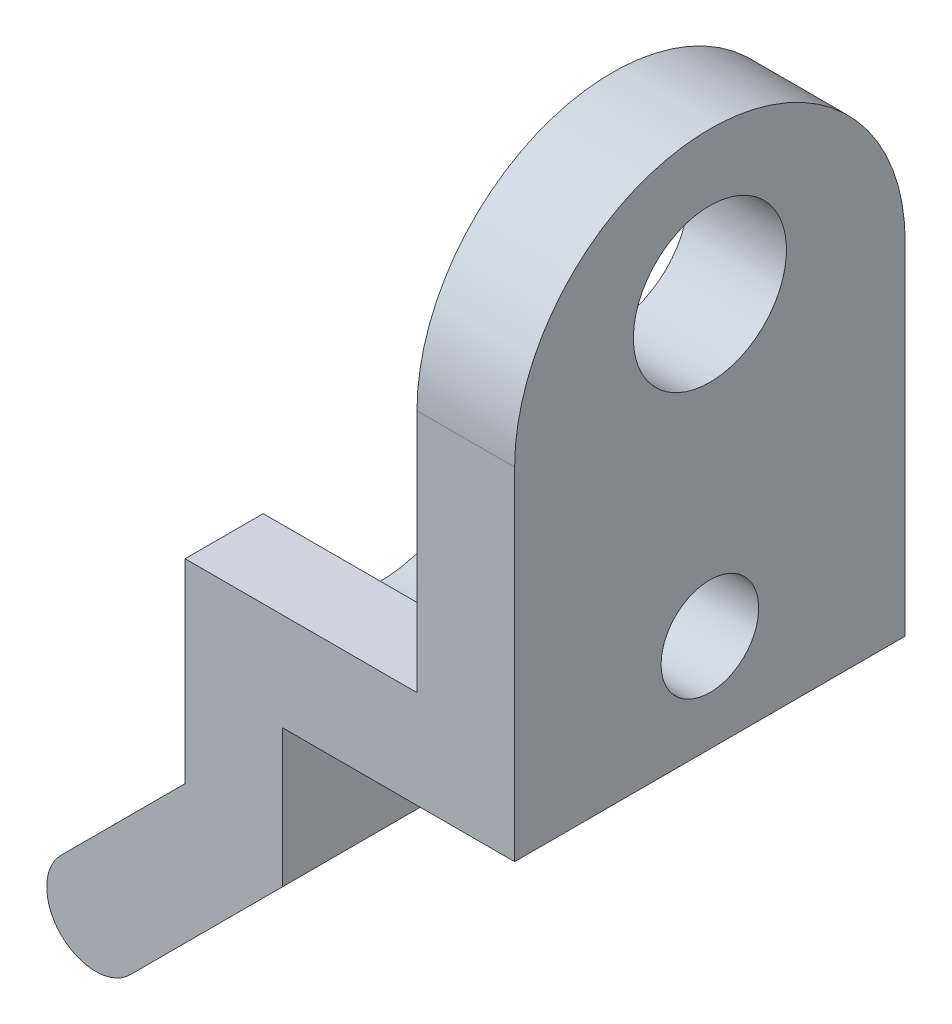
ISO-10303-21;
HEADER;
FILE_DESCRIPTION(('STEP AP214'),'2;1');
FILE_NAME('part.step','',(''),(''),'','','');
FILE_SCHEMA(('AUTOMOTIVE_DESIGN { 1 0 10303 214 1 1 1 1 }'));
ENDSEC;
DATA;
#1=APPLICATION_CONTEXT('core data for automotive mechanical design processes');
#2=APPLICATION_PROTOCOL_DEFINITION('international standard','automotive_design',2000,#1);
#3=PRODUCT_CONTEXT('',#1,'mechanical');
#4=PRODUCT('Part','Part','',(#3));
#5=PRODUCT_RELATED_PRODUCT_CATEGORY('part','',(#4));
#6=PRODUCT_DEFINITION_FORMATION('','',#4);
#7=PRODUCT_DEFINITION_CONTEXT('part definition',#1,'design');
#8=PRODUCT_DEFINITION('design','',#6,#7);
#9=PRODUCT_DEFINITION_SHAPE('','',#8);
#10=(LENGTH_UNIT() NAMED_UNIT(*) SI_UNIT(.MILLI.,.METRE.));
#11=(NAMED_UNIT(*) PLANE_ANGLE_UNIT() SI_UNIT($,.RADIAN.));
#12=(NAMED_UNIT(*) SI_UNIT($,.STERADIAN.) SOLID_ANGLE_UNIT());
#13=UNCERTAINTY_MEASURE_WITH_UNIT(LENGTH_MEASURE(1.E-05),#10,'distance_accuracy_value','');
#14=(GEOMETRIC_REPRESENTATION_CONTEXT(3) GLOBAL_UNCERTAINTY_ASSIGNED_CONTEXT((#13)) GLOBAL_UNIT_ASSIGNED_CONTEXT((#10,
#11,#12)) REPRESENTATION_CONTEXT('',''));
#15=CARTESIAN_POINT('',(0.,0.,0.));
#16=DIRECTION('',(0.,0.,1.));
#17=DIRECTION('',(1.,0.,0.));
#18=AXIS2_PLACEMENT_3D('',#15,#16,#17);
#19=CARTESIAN_POINT('',(0.,4.76250000000006,6.35));
#20=DIRECTION('',(0.,1.,0.));
#21=DIRECTION('',(0.,0.,1.));
#22=AXIS2_PLACEMENT_3D('',#19,#20,#21);
#23=PLANE('',#22);
#24=DIRECTION('',(-1.,0.,0.));
#25=VECTOR('',#24,1.);
#26=CARTESIAN_POINT('',(4.02943234528298,4.76250000000006,-3.81));
#27=LINE('',#26,#25);
#28=CARTESIAN_POINT('',(-6.746875,4.76250000000006,-3.81));
#29=VERTEX_POINT('',#28);
#30=CARTESIAN_POINT('',(-14.2874999999999,4.76250000000006,-3.81));
#31=VERTEX_POINT('',#30);
#32=EDGE_CURVE('E78',#29,#31,#27,.T.);
#33=ORIENTED_EDGE('',*,*,#32,.F.);
#34=DIRECTION('',(0.,0.,1.));
#35=VECTOR('',#34,1.);
#36=CARTESIAN_POINT('',(-6.746875,4.76250000000006,6.35));
#37=LINE('',#36,#35);
#38=CARTESIAN_POINT('',(-6.746875,4.76250000000006,-6.35));
#39=VERTEX_POINT('',#38);
#40=EDGE_CURVE('E261',#39,#29,#37,.T.);
#41=ORIENTED_EDGE('',*,*,#40,.F.);
#42=DIRECTION('',(1.,0.,0.));
#43=VECTOR('',#42,1.);
#44=CARTESIAN_POINT('',(0.,4.76250000000006,-6.35));
#45=LINE('',#44,#43);
#46=CARTESIAN_POINT('',(-14.2874999999999,4.76250000000006,-6.35));
#47=VERTEX_POINT('',#46);
#48=EDGE_CURVE('E186',#47,#39,#45,.T.);
#49=ORIENTED_EDGE('',*,*,#48,.F.);
#50=DIRECTION('',(0.,0.,-1.));
#51=VECTOR('',#50,1.);
#52=CARTESIAN_POINT('',(-14.2874999999999,4.76250000000006,6.35));
#53=LINE('',#52,#51);
#54=EDGE_CURVE('E323',#31,#47,#53,.T.);
#55=ORIENTED_EDGE('',*,*,#54,.F.);
#56=EDGE_LOOP('',(#33,#41,#49,#55));
#57=FACE_BOUND('',#56,.T.);
#58=ADVANCED_FACE('F48',(#57),#23,.T.);
#59=CARTESIAN_POINT('',(-6.35826106431797,6.35826106431797,6.35));
#60=DIRECTION('',(0.707106781186548,-0.707106781186548,0.));
#61=DIRECTION('',(0.707106781186548,0.707106781186548,0.));
#62=AXIS2_PLACEMENT_3D('',#59,#60,#61);
#63=PLANE('',#62);
#64=CARTESIAN_POINT('',(-16.0758571097189,-3.35933498108292,0.));
#65=DIRECTION('',(0.707106781186548,-0.707106781186548,0.));
#66=DIRECTION('',(0.707106781186548,0.707106781186548,0.));
#67=AXIS2_PLACEMENT_3D('',#64,#65,#66);
#68=CIRCLE('',#67,1.5875);
#69=CARTESIAN_POINT('',(-14.9533250945852,-2.23680296594928,0.));
#70=VERTEX_POINT('',#69);
#71=EDGE_CURVE('E265',#70,#70,#68,.T.);
#72=ORIENTED_EDGE('',*,*,#71,.T.);
#73=EDGE_LOOP('',(#72));
#74=FACE_BOUND('',#73,.T.);
#75=DIRECTION('',(-0.707106781186548,-0.707106781186548,0.));
#76=VECTOR('',#75,1.);
#77=CARTESIAN_POINT('',(-6.35826106431797,6.35826106431797,-6.35));
#78=LINE('',#77,#76);
#79=CARTESIAN_POINT('',(-14.2874999999999,-1.570977871364,-6.35));
#80=VERTEX_POINT('',#79);
#81=CARTESIAN_POINT('',(-18.3209211399862,-5.60439901135021,-6.35));
#82=VERTEX_POINT('',#81);
#83=EDGE_CURVE('E269',#80,#82,#78,.T.);
#84=ORIENTED_EDGE('',*,*,#83,.T.);
#85=DIRECTION('',(0.,0.,-1.));
#86=VECTOR('',#85,1.);
#87=CARTESIAN_POINT('',(-18.3209211399862,-5.60439901135021,6.35));
#88=LINE('',#87,#86);
#89=CARTESIAN_POINT('',(-18.3209211399862,-5.60439901135021,6.35));
#90=VERTEX_POINT('',#89);
#91=EDGE_CURVE('E58',#90,#82,#88,.T.);
#92=ORIENTED_EDGE('',*,*,#91,.F.);
#93=DIRECTION('',(-0.707106781186548,-0.707106781186548,0.));
#94=VECTOR('',#93,1.);
#95=CARTESIAN_POINT('',(-6.35826106431797,6.35826106431797,6.35));
#96=LINE('',#95,#94);
#97=CARTESIAN_POINT('',(-14.2874999999999,-1.570977871364,6.35));
#98=VERTEX_POINT('',#97);
#99=EDGE_CURVE('E270',#98,#90,#96,.T.);
#100=ORIENTED_EDGE('',*,*,#99,.F.);
#101=DIRECTION('',(0.,0.,-1.));
#102=VECTOR('',#101,1.);
#103=CARTESIAN_POINT('',(-14.2874999999999,-1.570977871364,6.35));
#104=LINE('',#103,#102);
#105=EDGE_CURVE('E297',#98,#80,#104,.T.);
#106=ORIENTED_EDGE('',*,*,#105,.T.);
#107=EDGE_LOOP('',(#84,#92,#100,#106));
#108=FACE_BOUND('',#107,.T.);
#109=ADVANCED_FACE('F51',(#74,#108),#63,.F.);
#110=CARTESIAN_POINT('',(-17.1983891248525,-6.72693102648386,6.35));
#111=DIRECTION('',(0.,0.,-1.));
#112=DIRECTION('',(-1.,0.,0.));
#113=AXIS2_PLACEMENT_3D('',#110,#111,#112);
#114=CYLINDRICAL_SURFACE('',#113,1.5875);
#115=CARTESIAN_POINT('',(-17.1983891248525,-6.72693102648386,-6.35));
#116=DIRECTION('',(0.,0.,1.));
#117=DIRECTION('',(1.,0.,0.));
#118=AXIS2_PLACEMENT_3D('',#115,#116,#117);
#119=CIRCLE('',#118,1.5875);
#120=CARTESIAN_POINT('',(-16.0758571097189,-7.8494630416175,-6.35));
#121=VERTEX_POINT('',#120);
#122=EDGE_CURVE('E301',#82,#121,#119,.T.);
#123=ORIENTED_EDGE('',*,*,#122,.T.);
#124=DIRECTION('',(0.,0.,-1.));
#125=VECTOR('',#124,1.);
#126=CARTESIAN_POINT('',(-16.0758571097189,-7.8494630416175,6.35));
#127=LINE('',#126,#125);
#128=CARTESIAN_POINT('',(-16.0758571097189,-7.8494630416175,6.35));
#129=VERTEX_POINT('',#128);
#130=EDGE_CURVE('E336',#129,#121,#127,.T.);
#131=ORIENTED_EDGE('',*,*,#130,.F.);
#132=CARTESIAN_POINT('',(-17.1983891248525,-6.72693102648386,6.35));
#133=DIRECTION('',(0.,0.,1.));
#134=DIRECTION('',(1.,0.,0.));
#135=AXIS2_PLACEMENT_3D('',#132,#133,#134);
#136=CIRCLE('',#135,1.5875);
#137=EDGE_CURVE('E274',#90,#129,#136,.T.);
#138=ORIENTED_EDGE('',*,*,#137,.F.);
#139=ORIENTED_EDGE('',*,*,#91,.T.);
#140=EDGE_LOOP('',(#123,#131,#138,#139));
#141=FACE_BOUND('',#140,.T.);
#142=ADVANCED_FACE('F352',(#141),#114,.T.);
#143=CARTESIAN_POINT('',(-4.11319703405068,4.11319703405068,6.35));
#144=DIRECTION('',(0.707106781186548,-0.707106781186548,0.));
#145=DIRECTION('',(0.707106781186548,0.707106781186548,0.));
#146=AXIS2_PLACEMENT_3D('',#143,#144,#145);
#147=PLANE('',#146);
#148=CARTESIAN_POINT('',(-13.8307930794516,-5.60439901135021,0.));
#149=DIRECTION('',(0.707106781186548,-0.707106781186548,0.));
#150=DIRECTION('',(0.707106781186548,0.707106781186548,0.));
#151=AXIS2_PLACEMENT_3D('',#148,#149,#150);
#152=CIRCLE('',#151,1.5875);
#153=CARTESIAN_POINT('',(-12.7082610643179,-4.48186699621656,0.));
#154=VERTEX_POINT('',#153);
#155=EDGE_CURVE('E264',#154,#154,#152,.T.);
#156=ORIENTED_EDGE('',*,*,#155,.F.);
#157=EDGE_LOOP('',(#156));
#158=FACE_BOUND('',#157,.T.);
#159=DIRECTION('',(-0.707106781186548,-0.707106781186548,0.));
#160=VECTOR('',#159,1.);
#161=CARTESIAN_POINT('',(-4.11319703405068,4.11319703405068,-6.35));
#162=LINE('',#161,#160);
#163=CARTESIAN_POINT('',(-11.1124999999999,-2.88610593189857,-6.35));
#164=VERTEX_POINT('',#163);
#165=EDGE_CURVE('E305',#164,#121,#162,.T.);
#166=ORIENTED_EDGE('',*,*,#165,.F.);
#167=DIRECTION('',(0.,0.,-1.));
#168=VECTOR('',#167,1.);
#169=CARTESIAN_POINT('',(-11.1124999999999,-2.88610593189857,6.35));
#170=LINE('',#169,#168);
#171=CARTESIAN_POINT('',(-11.1124999999999,-2.88610593189857,6.35));
#172=VERTEX_POINT('',#171);
#173=EDGE_CURVE('E333',#172,#164,#170,.T.);
#174=ORIENTED_EDGE('',*,*,#173,.F.);
#175=DIRECTION('',(-0.707106781186548,-0.707106781186548,0.));
#176=VECTOR('',#175,1.);
#177=CARTESIAN_POINT('',(-4.11319703405068,4.11319703405068,6.35));
#178=LINE('',#177,#176);
#179=EDGE_CURVE('E278',#172,#129,#178,.T.);
#180=ORIENTED_EDGE('',*,*,#179,.T.);
#181=ORIENTED_EDGE('',*,*,#130,.T.);
#182=EDGE_LOOP('',(#166,#174,#180,#181));
#183=FACE_BOUND('',#182,.T.);
#184=ADVANCED_FACE('F348',(#158,#183),#147,.T.);
#185=CARTESIAN_POINT('',(-11.1124999999999,0.,6.35));
#186=DIRECTION('',(-1.,0.,0.));
#187=DIRECTION('',(0.,0.,1.));
#188=AXIS2_PLACEMENT_3D('',#185,#186,#187);
#189=PLANE('',#188);
#190=DIRECTION('',(0.,0.,-1.));
#191=VECTOR('',#190,1.);
#192=CARTESIAN_POINT('',(-11.1124999999999,1.58750000000006,6.35));
#193=LINE('',#192,#191);
#194=CARTESIAN_POINT('',(-11.1124999999999,1.58750000000006,-2.10605674187568));
#195=VERTEX_POINT('',#194);
#196=CARTESIAN_POINT('',(-11.1124999999999,1.58750000000006,-6.35));
#197=VERTEX_POINT('',#196);
#198=EDGE_CURVE('E328',#195,#197,#193,.T.);
#199=ORIENTED_EDGE('',*,*,#198,.F.);
#200=CARTESIAN_POINT('',(-11.1124999999999,4.76250000000006,0.));
#201=DIRECTION('',(-1.,0.,0.));
#202=DIRECTION('',(0.,0.,1.));
#203=AXIS2_PLACEMENT_3D('',#200,#201,#202);
#204=CIRCLE('',#203,3.81);
#205=CARTESIAN_POINT('',(-11.1124999999999,1.58750000000006,2.10605674187568));
#206=VERTEX_POINT('',#205);
#207=EDGE_CURVE('E244',#195,#206,#204,.T.);
#208=ORIENTED_EDGE('',*,*,#207,.T.);
#209=CARTESIAN_POINT('',(-11.1124999999999,1.58750000000006,6.35));
#210=VERTEX_POINT('',#209);
#211=EDGE_CURVE('E329',#210,#206,#193,.T.);
#212=ORIENTED_EDGE('',*,*,#211,.F.);
#213=DIRECTION('',(0.,1.,0.));
#214=VECTOR('',#213,1.);
#215=CARTESIAN_POINT('',(-11.1124999999999,0.,6.35));
#216=LINE('',#215,#214);
#217=EDGE_CURVE('E282',#172,#210,#216,.T.);
#218=ORIENTED_EDGE('',*,*,#217,.F.);
#219=ORIENTED_EDGE('',*,*,#173,.T.);
#220=DIRECTION('',(0.,1.,0.));
#221=VECTOR('',#220,1.);
#222=CARTESIAN_POINT('',(-11.1124999999999,0.,-6.35));
#223=LINE('',#222,#221);
#224=EDGE_CURVE('E309',#164,#197,#223,.T.);
#225=ORIENTED_EDGE('',*,*,#224,.T.);
#226=EDGE_LOOP('',(#199,#208,#212,#218,#219,#225));
#227=FACE_BOUND('',#226,.T.);
#228=ADVANCED_FACE('F351',(#227),#189,.F.);
#229=CARTESIAN_POINT('',(0.,1.58750000000006,6.35));
#230=DIRECTION('',(0.,1.,0.));
#231=DIRECTION('',(0.,0.,1.));
#232=AXIS2_PLACEMENT_3D('',#229,#230,#231);
#233=PLANE('',#232);
#234=DIRECTION('',(1.,0.,0.));
#235=VECTOR('',#234,1.);
#236=CARTESIAN_POINT('',(0.,1.58750000000006,-6.35));
#237=LINE('',#236,#235);
#238=CARTESIAN_POINT('',(-3.571875,1.58750000000006,-6.35));
#239=VERTEX_POINT('',#238);
#240=EDGE_CURVE('E313',#197,#239,#237,.T.);
#241=ORIENTED_EDGE('',*,*,#240,.T.);
#242=DIRECTION('',(0.,0.,1.));
#243=VECTOR('',#242,1.);
#244=CARTESIAN_POINT('',(-3.571875,1.58750000000006,-6.35));
#245=LINE('',#244,#243);
#246=CARTESIAN_POINT('',(-3.571875,1.58750000000006,6.35));
#247=VERTEX_POINT('',#246);
#248=EDGE_CURVE('E220',#239,#247,#245,.T.);
#249=ORIENTED_EDGE('',*,*,#248,.T.);
#250=DIRECTION('',(1.,0.,0.));
#251=VECTOR('',#250,1.);
#252=CARTESIAN_POINT('',(0.,1.58750000000006,6.35));
#253=LINE('',#252,#251);
#254=EDGE_CURVE('E285',#210,#247,#253,.T.);
#255=ORIENTED_EDGE('',*,*,#254,.F.);
#256=ORIENTED_EDGE('',*,*,#211,.T.);
#257=DIRECTION('',(-1.,0.,0.));
#258=VECTOR('',#257,1.);
#259=CARTESIAN_POINT('',(4.02943234528298,1.58750000000006,2.10605674187568));
#260=LINE('',#259,#258);
#261=CARTESIAN_POINT('',(-6.746875,1.58750000000006,2.10605674187568));
#262=VERTEX_POINT('',#261);
#263=EDGE_CURVE('E240',#206,#262,#260,.F.);
#264=ORIENTED_EDGE('',*,*,#263,.T.);
#265=DIRECTION('',(0.,0.,1.));
#266=VECTOR('',#265,1.);
#267=CARTESIAN_POINT('',(-6.746875,1.58750000000006,6.35));
#268=LINE('',#267,#266);
#269=CARTESIAN_POINT('',(-6.746875,1.58750000000006,-2.10605674187568));
#270=VERTEX_POINT('',#269);
#271=EDGE_CURVE('E191',#270,#262,#268,.T.);
#272=ORIENTED_EDGE('',*,*,#271,.F.);
#273=DIRECTION('',(-1.,0.,0.));
#274=VECTOR('',#273,1.);
#275=CARTESIAN_POINT('',(4.02943234528298,1.58750000000006,-2.10605674187568));
#276=LINE('',#275,#274);
#277=EDGE_CURVE('E248',#270,#195,#276,.T.);
#278=ORIENTED_EDGE('',*,*,#277,.T.);
#279=ORIENTED_EDGE('',*,*,#198,.T.);
#280=EDGE_LOOP('',(#241,#249,#255,#256,#264,#272,#278,#279));
#281=FACE_BOUND('',#280,.T.);
#282=ADVANCED_FACE('F388',(#281),#233,.F.);
#283=DIRECTION('',(-1.,0.,0.));
#284=VECTOR('',#283,1.);
#285=CARTESIAN_POINT('',(4.02943234528298,4.76250000000006,3.81));
#286=LINE('',#285,#284);
#287=CARTESIAN_POINT('',(-14.2874999999999,4.76250000000006,3.81));
#288=VERTEX_POINT('',#287);
#289=CARTESIAN_POINT('',(-6.746875,4.76250000000006,3.81));
#290=VERTEX_POINT('',#289);
#291=EDGE_CURVE('E235',#288,#290,#286,.F.);
#292=ORIENTED_EDGE('',*,*,#291,.F.);
#293=CARTESIAN_POINT('',(-14.2874999999999,4.76250000000006,6.35));
#294=VERTEX_POINT('',#293);
#295=EDGE_CURVE('E324',#294,#288,#53,.T.);
#296=ORIENTED_EDGE('',*,*,#295,.F.);
#297=DIRECTION('',(1.,0.,0.));
#298=VECTOR('',#297,1.);
#299=CARTESIAN_POINT('',(0.,4.76250000000006,6.35));
#300=LINE('',#299,#298);
#301=CARTESIAN_POINT('',(-6.746875,4.76250000000006,6.35));
#302=VERTEX_POINT('',#301);
#303=EDGE_CURVE('E289',#294,#302,#300,.T.);
#304=ORIENTED_EDGE('',*,*,#303,.T.);
#305=EDGE_CURVE('E257',#290,#302,#37,.T.);
#306=ORIENTED_EDGE('',*,*,#305,.F.);
#307=EDGE_LOOP('',(#292,#296,#304,#306));
#308=FACE_BOUND('',#307,.T.);
#309=ADVANCED_FACE('F380',(#308),#23,.T.);
#310=CARTESIAN_POINT('',(-14.2874999999999,0.,6.35));
#311=DIRECTION('',(-1.,0.,0.));
#312=DIRECTION('',(0.,0.,1.));
#313=AXIS2_PLACEMENT_3D('',#310,#311,#312);
#314=PLANE('',#313);
#315=CARTESIAN_POINT('',(-14.2874999999999,4.76250000000006,0.));
#316=DIRECTION('',(-1.,0.,0.));
#317=DIRECTION('',(0.,0.,1.));
#318=AXIS2_PLACEMENT_3D('',#315,#316,#317);
#319=CIRCLE('',#318,3.81);
#320=EDGE_CURVE('E228',#31,#288,#319,.T.);
#321=ORIENTED_EDGE('',*,*,#320,.F.);
#322=ORIENTED_EDGE('',*,*,#54,.T.);
#323=DIRECTION('',(0.,1.,0.));
#324=VECTOR('',#323,1.);
#325=CARTESIAN_POINT('',(-14.2874999999999,0.,-6.35));
#326=LINE('',#325,#324);
#327=EDGE_CURVE('E275',#80,#47,#326,.T.);
#328=ORIENTED_EDGE('',*,*,#327,.F.);
#329=ORIENTED_EDGE('',*,*,#105,.F.);
#330=DIRECTION('',(0.,1.,0.));
#331=VECTOR('',#330,1.);
#332=CARTESIAN_POINT('',(-14.2874999999999,0.,6.35));
#333=LINE('',#332,#331);
#334=EDGE_CURVE('E293',#98,#294,#333,.T.);
#335=ORIENTED_EDGE('',*,*,#334,.T.);
#336=ORIENTED_EDGE('',*,*,#295,.T.);
#337=EDGE_LOOP('',(#321,#322,#328,#329,#335,#336));
#338=FACE_BOUND('',#337,.T.);
#339=ADVANCED_FACE('F374',(#338),#314,.T.);
#340=CARTESIAN_POINT('',(0.,0.,6.35));
#341=DIRECTION('',(0.,0.,1.));
#342=DIRECTION('',(1.,0.,0.));
#343=AXIS2_PLACEMENT_3D('',#340,#341,#342);
#344=PLANE('',#343);
#345=ORIENTED_EDGE('',*,*,#254,.T.);
#346=DIRECTION('',(0.,1.,0.));
#347=VECTOR('',#346,1.);
#348=CARTESIAN_POINT('',(-3.571875,0.,6.35));
#349=LINE('',#348,#347);
#350=CARTESIAN_POINT('',(-3.571875,12.7000000000001,6.35));
#351=VERTEX_POINT('',#350);
#352=EDGE_CURVE('E255',#247,#351,#349,.T.);
#353=ORIENTED_EDGE('',*,*,#352,.T.);
#354=DIRECTION('',(1.,0.,0.));
#355=VECTOR('',#354,1.);
#356=CARTESIAN_POINT('',(-22.621875,12.7000000000001,6.35));
#357=LINE('',#356,#355);
#358=CARTESIAN_POINT('',(-6.746875,12.7000000000001,6.35));
#359=VERTEX_POINT('',#358);
#360=EDGE_CURVE('E201',#359,#351,#357,.T.);
#361=ORIENTED_EDGE('',*,*,#360,.F.);
#362=DIRECTION('',(0.,1.,0.));
#363=VECTOR('',#362,1.);
#364=CARTESIAN_POINT('',(-6.746875,0.,6.35));
#365=LINE('',#364,#363);
#366=EDGE_CURVE('E205',#302,#359,#365,.T.);
#367=ORIENTED_EDGE('',*,*,#366,.F.);
#368=ORIENTED_EDGE('',*,*,#303,.F.);
#369=ORIENTED_EDGE('',*,*,#334,.F.);
#370=ORIENTED_EDGE('',*,*,#99,.T.);
#371=ORIENTED_EDGE('',*,*,#137,.T.);
#372=ORIENTED_EDGE('',*,*,#179,.F.);
#373=ORIENTED_EDGE('',*,*,#217,.T.);
#374=EDGE_LOOP('',(#345,#353,#361,#367,#368,#369,#370,#371,#372,#373));
#375=FACE_BOUND('',#374,.T.);
#376=ADVANCED_FACE('F366',(#375),#344,.T.);
#377=CARTESIAN_POINT('',(0.,0.,-6.35));
#378=DIRECTION('',(0.,0.,1.));
#379=DIRECTION('',(1.,0.,0.));
#380=AXIS2_PLACEMENT_3D('',#377,#378,#379);
#381=PLANE('',#380);
#382=DIRECTION('',(0.,1.,0.));
#383=VECTOR('',#382,1.);
#384=CARTESIAN_POINT('',(-3.571875,0.,-6.35));
#385=LINE('',#384,#383);
#386=CARTESIAN_POINT('',(-3.571875,12.7000000000001,-6.35));
#387=VERTEX_POINT('',#386);
#388=EDGE_CURVE('E190',#239,#387,#385,.T.);
#389=ORIENTED_EDGE('',*,*,#388,.F.);
#390=ORIENTED_EDGE('',*,*,#240,.F.);
#391=ORIENTED_EDGE('',*,*,#224,.F.);
#392=ORIENTED_EDGE('',*,*,#165,.T.);
#393=ORIENTED_EDGE('',*,*,#122,.F.);
#394=ORIENTED_EDGE('',*,*,#83,.F.);
#395=ORIENTED_EDGE('',*,*,#327,.T.);
#396=ORIENTED_EDGE('',*,*,#48,.T.);
#397=DIRECTION('',(0.,1.,0.));
#398=VECTOR('',#397,1.);
#399=CARTESIAN_POINT('',(-6.746875,0.,-6.35));
#400=LINE('',#399,#398);
#401=CARTESIAN_POINT('',(-6.74687500000001,12.7000000000001,-6.35));
#402=VERTEX_POINT('',#401);
#403=EDGE_CURVE('E179',#39,#402,#400,.T.);
#404=ORIENTED_EDGE('',*,*,#403,.T.);
#405=DIRECTION('',(1.,0.,0.));
#406=VECTOR('',#405,1.);
#407=CARTESIAN_POINT('',(-22.621875,12.7000000000001,-6.35));
#408=LINE('',#407,#406);
#409=EDGE_CURVE('E182',#402,#387,#408,.T.);
#410=ORIENTED_EDGE('',*,*,#409,.T.);
#411=EDGE_LOOP('',(#389,#390,#391,#392,#393,#394,#395,#396,#404,#410));
#412=FACE_BOUND('',#411,.T.);
#413=ADVANCED_FACE('F181',(#412),#381,.F.);
#414=CARTESIAN_POINT('',(-21.4917906078272,2.05659851702539,0.));
#415=DIRECTION('',(0.707106781186548,-0.707106781186547,0.));
#416=DIRECTION('',(0.707106781186547,0.707106781186548,0.));
#417=AXIS2_PLACEMENT_3D('',#414,#415,#416);
#418=CYLINDRICAL_SURFACE('',#417,1.5875);
#419=ORIENTED_EDGE('',*,*,#155,.T.);
#420=EDGE_LOOP('',(#419));
#421=FACE_BOUND('',#420,.T.);
#422=ORIENTED_EDGE('',*,*,#71,.F.);
#423=EDGE_LOOP('',(#422));
#424=FACE_BOUND('',#423,.T.);
#425=ADVANCED_FACE('F345',(#421,#424),#418,.F.);
#426=CARTESIAN_POINT('',(-6.746875,0.,6.35));
#427=DIRECTION('',(-1.,0.,0.));
#428=DIRECTION('',(0.,0.,1.));
#429=AXIS2_PLACEMENT_3D('',#426,#427,#428);
#430=PLANE('',#429);
#431=CARTESIAN_POINT('',(-6.746875,14.4014773719377,0.));
#432=DIRECTION('',(-1.,0.,0.));
#433=DIRECTION('',(0.,0.,1.));
#434=AXIS2_PLACEMENT_3D('',#431,#432,#433);
#435=CIRCLE('',#434,2.4892);
#436=CARTESIAN_POINT('',(-6.746875,14.4014773719377,2.4892));
#437=VERTEX_POINT('',#436);
#438=EDGE_CURVE('E208',#437,#437,#435,.T.);
#439=ORIENTED_EDGE('',*,*,#438,.F.);
#440=EDGE_LOOP('',(#439));
#441=FACE_BOUND('',#440,.T.);
#442=CARTESIAN_POINT('',(-6.746875,4.76250000000006,0.));
#443=DIRECTION('',(-1.,0.,0.));
#444=DIRECTION('',(0.,0.,1.));
#445=AXIS2_PLACEMENT_3D('',#442,#443,#444);
#446=CIRCLE('',#445,1.5875);
#447=CARTESIAN_POINT('',(-6.746875,4.76250000000006,1.5875));
#448=VERTEX_POINT('',#447);
#449=EDGE_CURVE('E224',#448,#448,#446,.T.);
#450=ORIENTED_EDGE('',*,*,#449,.F.);
#451=EDGE_LOOP('',(#450));
#452=FACE_BOUND('',#451,.T.);
#453=ORIENTED_EDGE('',*,*,#40,.T.);
#454=CARTESIAN_POINT('',(-6.746875,4.76250000000006,0.));
#455=DIRECTION('',(-1.,0.,0.));
#456=DIRECTION('',(0.,0.,1.));
#457=AXIS2_PLACEMENT_3D('',#454,#455,#456);
#458=CIRCLE('',#457,3.81);
#459=EDGE_CURVE('E68',#270,#29,#458,.F.);
#460=ORIENTED_EDGE('',*,*,#459,.F.);
#461=ORIENTED_EDGE('',*,*,#271,.T.);
#462=EDGE_CURVE('E231',#290,#262,#458,.F.);
#463=ORIENTED_EDGE('',*,*,#462,.F.);
#464=ORIENTED_EDGE('',*,*,#305,.T.);
#465=ORIENTED_EDGE('',*,*,#366,.T.);
#466=CARTESIAN_POINT('',(-6.746875,12.7000000000001,0.));
#467=DIRECTION('',(-1.,0.,0.));
#468=DIRECTION('',(0.,0.,1.));
#469=AXIS2_PLACEMENT_3D('',#466,#467,#468);
#470=CIRCLE('',#469,6.35);
#471=EDGE_CURVE('E197',#402,#359,#470,.F.);
#472=ORIENTED_EDGE('',*,*,#471,.F.);
#473=ORIENTED_EDGE('',*,*,#403,.F.);
#474=EDGE_LOOP('',(#453,#460,#461,#463,#464,#465,#472,#473));
#475=FACE_BOUND('',#474,.T.);
#476=ADVANCED_FACE('F203',(#441,#452,#475),#430,.T.);
#477=CARTESIAN_POINT('',(-3.571875,0.,6.35));
#478=DIRECTION('',(-1.,0.,0.));
#479=DIRECTION('',(0.,0.,1.));
#480=AXIS2_PLACEMENT_3D('',#477,#478,#479);
#481=PLANE('',#480);
#482=CARTESIAN_POINT('',(-3.571875,14.4014773719377,0.));
#483=DIRECTION('',(-1.,0.,0.));
#484=DIRECTION('',(0.,0.,1.));
#485=AXIS2_PLACEMENT_3D('',#482,#483,#484);
#486=CIRCLE('',#485,2.4892);
#487=CARTESIAN_POINT('',(-3.571875,14.4014773719377,2.4892));
#488=VERTEX_POINT('',#487);
#489=EDGE_CURVE('E216',#488,#488,#486,.T.);
#490=ORIENTED_EDGE('',*,*,#489,.T.);
#491=EDGE_LOOP('',(#490));
#492=FACE_BOUND('',#491,.T.);
#493=ORIENTED_EDGE('',*,*,#352,.F.);
#494=ORIENTED_EDGE('',*,*,#248,.F.);
#495=ORIENTED_EDGE('',*,*,#388,.T.);
#496=CARTESIAN_POINT('',(-3.571875,12.7000000000001,0.));
#497=DIRECTION('',(1.,0.,0.));
#498=DIRECTION('',(0.,0.,-1.));
#499=AXIS2_PLACEMENT_3D('',#496,#497,#498);
#500=CIRCLE('',#499,6.35);
#501=EDGE_CURVE('E199',#387,#351,#500,.T.);
#502=ORIENTED_EDGE('',*,*,#501,.T.);
#503=EDGE_LOOP('',(#493,#494,#495,#502));
#504=FACE_BOUND('',#503,.T.);
#505=CARTESIAN_POINT('',(-3.571875,4.76250000000006,0.));
#506=DIRECTION('',(-1.,0.,0.));
#507=DIRECTION('',(0.,0.,1.));
#508=AXIS2_PLACEMENT_3D('',#505,#506,#507);
#509=CIRCLE('',#508,1.5875);
#510=CARTESIAN_POINT('',(-3.571875,4.76250000000006,1.5875));
#511=VERTEX_POINT('',#510);
#512=EDGE_CURVE('E11',#511,#511,#509,.T.);
#513=ORIENTED_EDGE('',*,*,#512,.T.);
#514=EDGE_LOOP('',(#513));
#515=FACE_BOUND('',#514,.T.);
#516=ADVANCED_FACE('F399',(#492,#504,#515),#481,.F.);
#517=CARTESIAN_POINT('',(4.02943234528298,4.76250000000006,0.));
#518=DIRECTION('',(-1.,0.,0.));
#519=DIRECTION('',(0.,0.,1.));
#520=AXIS2_PLACEMENT_3D('',#517,#518,#519);
#521=CYLINDRICAL_SURFACE('',#520,3.81);
#522=ORIENTED_EDGE('',*,*,#459,.T.);
#523=ORIENTED_EDGE('',*,*,#32,.T.);
#524=ORIENTED_EDGE('',*,*,#320,.T.);
#525=ORIENTED_EDGE('',*,*,#291,.T.);
#526=ORIENTED_EDGE('',*,*,#462,.T.);
#527=ORIENTED_EDGE('',*,*,#263,.F.);
#528=ORIENTED_EDGE('',*,*,#207,.F.);
#529=ORIENTED_EDGE('',*,*,#277,.F.);
#530=EDGE_LOOP('',(#522,#523,#524,#525,#526,#527,#528,#529));
#531=FACE_BOUND('',#530,.T.);
#532=ADVANCED_FACE('F425',(#531),#521,.F.);
#533=CARTESIAN_POINT('',(0.,4.76250000000006,0.));
#534=DIRECTION('',(-1.,0.,0.));
#535=DIRECTION('',(0.,0.,1.));
#536=AXIS2_PLACEMENT_3D('',#533,#534,#535);
#537=CYLINDRICAL_SURFACE('',#536,1.5875);
#538=ORIENTED_EDGE('',*,*,#449,.T.);
#539=EDGE_LOOP('',(#538));
#540=FACE_BOUND('',#539,.T.);
#541=ORIENTED_EDGE('',*,*,#512,.F.);
#542=EDGE_LOOP('',(#541));
#543=FACE_BOUND('',#542,.T.);
#544=ADVANCED_FACE('F416',(#540,#543),#537,.F.);
#545=CARTESIAN_POINT('',(-22.621875,12.7000000000001,0.));
#546=DIRECTION('',(1.,0.,0.));
#547=DIRECTION('',(0.,0.,-1.));
#548=AXIS2_PLACEMENT_3D('',#545,#546,#547);
#549=CYLINDRICAL_SURFACE('',#548,6.35);
#550=ORIENTED_EDGE('',*,*,#409,.F.);
#551=ORIENTED_EDGE('',*,*,#471,.T.);
#552=ORIENTED_EDGE('',*,*,#360,.T.);
#553=ORIENTED_EDGE('',*,*,#501,.F.);
#554=EDGE_LOOP('',(#550,#551,#552,#553));
#555=FACE_BOUND('',#554,.T.);
#556=ADVANCED_FACE('F195',(#555),#549,.T.);
#557=CARTESIAN_POINT('',(-3.571875,14.4014773719377,0.));
#558=DIRECTION('',(-1.,0.,0.));
#559=DIRECTION('',(0.,0.,1.));
#560=AXIS2_PLACEMENT_3D('',#557,#558,#559);
#561=CYLINDRICAL_SURFACE('',#560,2.4892);
#562=ORIENTED_EDGE('',*,*,#438,.T.);
#563=EDGE_LOOP('',(#562));
#564=FACE_BOUND('',#563,.T.);
#565=ORIENTED_EDGE('',*,*,#489,.F.);
#566=EDGE_LOOP('',(#565));
#567=FACE_BOUND('',#566,.T.);
#568=ADVANCED_FACE('F408',(#564,#567),#561,.F.);
#569=CLOSED_SHELL('',(#58,#109,#142,#184,#228,#282,#309,#339,#376,#413,#425,#476,#516,#532,#544,
#556,#568));
#570=MANIFOLD_SOLID_BREP('B2',#569);
#571=ADVANCED_BREP_SHAPE_REPRESENTATION('',(#18,#570),#14);
#572=SHAPE_DEFINITION_REPRESENTATION(#9,#571);
ENDSEC;
END-ISO-10303-21;
